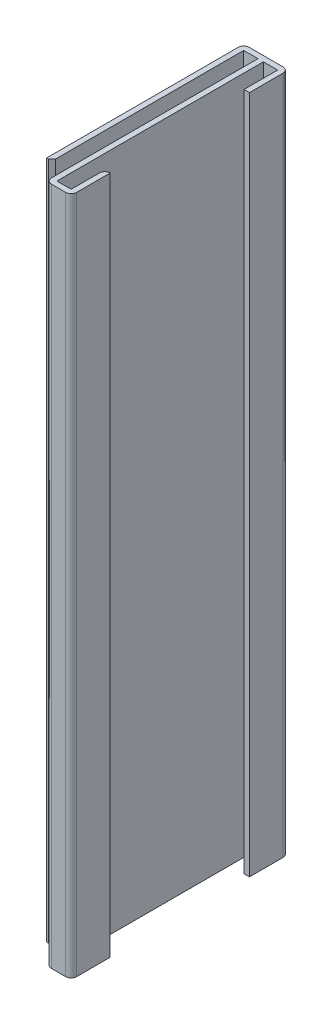
ISO-10303-21;
HEADER;
FILE_DESCRIPTION(('STEP AP214'),'2;1');
FILE_NAME('part.step','',(''),(''),'','','');
FILE_SCHEMA(('AUTOMOTIVE_DESIGN { 1 0 10303 214 1 1 1 1 }'));
ENDSEC;
DATA;
#1=APPLICATION_CONTEXT('core data for automotive mechanical design processes');
#2=APPLICATION_PROTOCOL_DEFINITION('international standard','automotive_design',2000,#1);
#3=PRODUCT_CONTEXT('',#1,'mechanical');
#4=PRODUCT('Part','Part','',(#3));
#5=PRODUCT_RELATED_PRODUCT_CATEGORY('part','',(#4));
#6=PRODUCT_DEFINITION_FORMATION('','',#4);
#7=PRODUCT_DEFINITION_CONTEXT('part definition',#1,'design');
#8=PRODUCT_DEFINITION('design','',#6,#7);
#9=PRODUCT_DEFINITION_SHAPE('','',#8);
#10=(LENGTH_UNIT() NAMED_UNIT(*) SI_UNIT(.MILLI.,.METRE.));
#11=(NAMED_UNIT(*) PLANE_ANGLE_UNIT() SI_UNIT($,.RADIAN.));
#12=(NAMED_UNIT(*) SI_UNIT($,.STERADIAN.) SOLID_ANGLE_UNIT());
#13=UNCERTAINTY_MEASURE_WITH_UNIT(LENGTH_MEASURE(1.E-05),#10,'distance_accuracy_value','');
#14=(GEOMETRIC_REPRESENTATION_CONTEXT(3) GLOBAL_UNCERTAINTY_ASSIGNED_CONTEXT((#13)) GLOBAL_UNIT_ASSIGNED_CONTEXT((#10,
#11,#12)) REPRESENTATION_CONTEXT('',''));
#15=CARTESIAN_POINT('',(0.,0.,0.));
#16=DIRECTION('',(0.,0.,1.));
#17=DIRECTION('',(1.,0.,0.));
#18=AXIS2_PLACEMENT_3D('',#15,#16,#17);
#19=CARTESIAN_POINT('',(3.3,0.,-32.));
#20=DIRECTION('',(0.,0.,-1.));
#21=DIRECTION('',(0.,-1.,0.));
#22=AXIS2_PLACEMENT_3D('',#19,#20,#21);
#23=PLANE('',#22);
#24=DIRECTION('',(-1.,0.,0.));
#25=VECTOR('',#24,1.);
#26=CARTESIAN_POINT('',(2.5,0.,-32.));
#27=LINE('',#26,#25);
#28=CARTESIAN_POINT('',(2.5,0.,-32.));
#29=VERTEX_POINT('',#28);
#30=CARTESIAN_POINT('',(-2.5,0.,-32.));
#31=VERTEX_POINT('',#30);
#32=EDGE_CURVE('E336',#29,#31,#27,.T.);
#33=ORIENTED_EDGE('',*,*,#32,.T.);
#34=DIRECTION('',(0.,-1.,0.));
#35=VECTOR('',#34,1.);
#36=CARTESIAN_POINT('',(-2.5,100.,-32.));
#37=LINE('',#36,#35);
#38=CARTESIAN_POINT('',(-2.5,100.,-32.));
#39=VERTEX_POINT('',#38);
#40=EDGE_CURVE('E10',#39,#31,#37,.T.);
#41=ORIENTED_EDGE('',*,*,#40,.F.);
#42=DIRECTION('',(-1.,0.,0.));
#43=VECTOR('',#42,1.);
#44=CARTESIAN_POINT('',(2.5,100.,-32.));
#45=LINE('',#44,#43);
#46=CARTESIAN_POINT('',(2.5,100.,-32.));
#47=VERTEX_POINT('',#46);
#48=EDGE_CURVE('E372',#47,#39,#45,.T.);
#49=ORIENTED_EDGE('',*,*,#48,.F.);
#50=DIRECTION('',(0.,-1.,0.));
#51=VECTOR('',#50,1.);
#52=CARTESIAN_POINT('',(2.5,100.,-32.));
#53=LINE('',#52,#51);
#54=EDGE_CURVE('E281',#47,#29,#53,.T.);
#55=ORIENTED_EDGE('',*,*,#54,.T.);
#56=EDGE_LOOP('',(#33,#41,#49,#55));
#57=FACE_BOUND('',#56,.T.);
#58=ADVANCED_FACE('F15',(#57),#23,.T.);
#59=CARTESIAN_POINT('',(-2.5,100.1646142425,-31.2));
#60=DIRECTION('',(0.,-1.,0.));
#61=DIRECTION('',(-1.,0.,0.));
#62=AXIS2_PLACEMENT_3D('',#59,#60,#61);
#63=CYLINDRICAL_SURFACE('',#62,0.8);
#64=CARTESIAN_POINT('',(-2.5,0.,-31.2));
#65=DIRECTION('',(0.,-1.,0.));
#66=DIRECTION('',(-1.,0.,0.));
#67=AXIS2_PLACEMENT_3D('',#64,#65,#66);
#68=CIRCLE('',#67,0.8);
#69=CARTESIAN_POINT('',(-3.3,0.,-31.2));
#70=VERTEX_POINT('',#69);
#71=EDGE_CURVE('E340',#70,#31,#68,.T.);
#72=ORIENTED_EDGE('',*,*,#71,.F.);
#73=DIRECTION('',(0.,-1.,0.));
#74=VECTOR('',#73,1.);
#75=CARTESIAN_POINT('',(-3.3,100.,-31.2));
#76=LINE('',#75,#74);
#77=CARTESIAN_POINT('',(-3.3,100.,-31.2));
#78=VERTEX_POINT('',#77);
#79=EDGE_CURVE('E26',#78,#70,#76,.T.);
#80=ORIENTED_EDGE('',*,*,#79,.F.);
#81=CARTESIAN_POINT('',(-2.5,100.,-31.2));
#82=DIRECTION('',(0.,1.,0.));
#83=DIRECTION('',(0.,0.,-1.));
#84=AXIS2_PLACEMENT_3D('',#81,#82,#83);
#85=CIRCLE('',#84,0.8);
#86=EDGE_CURVE('E276',#39,#78,#85,.T.);
#87=ORIENTED_EDGE('',*,*,#86,.F.);
#88=ORIENTED_EDGE('',*,*,#40,.T.);
#89=EDGE_LOOP('',(#72,#80,#87,#88));
#90=FACE_BOUND('',#89,.T.);
#91=ADVANCED_FACE('F424',(#90),#63,.T.);
#92=CARTESIAN_POINT('',(-3.3,0.,-32.));
#93=DIRECTION('',(-1.,0.,0.));
#94=DIRECTION('',(0.,0.,1.));
#95=AXIS2_PLACEMENT_3D('',#92,#93,#94);
#96=PLANE('',#95);
#97=DIRECTION('',(0.,0.,1.));
#98=VECTOR('',#97,1.);
#99=CARTESIAN_POINT('',(-3.3,0.,-31.2));
#100=LINE('',#99,#98);
#101=CARTESIAN_POINT('',(-3.3,0.,-3.));
#102=VERTEX_POINT('',#101);
#103=EDGE_CURVE('E382',#70,#102,#100,.T.);
#104=ORIENTED_EDGE('',*,*,#103,.T.);
#105=DIRECTION('',(0.,1.,0.));
#106=VECTOR('',#105,1.);
#107=CARTESIAN_POINT('',(-3.3,0.,-3.));
#108=LINE('',#107,#106);
#109=CARTESIAN_POINT('',(-3.3,100.,-3.));
#110=VERTEX_POINT('',#109);
#111=EDGE_CURVE('E303',#102,#110,#108,.T.);
#112=ORIENTED_EDGE('',*,*,#111,.T.);
#113=DIRECTION('',(0.,0.,1.));
#114=VECTOR('',#113,1.);
#115=CARTESIAN_POINT('',(-3.3,100.,-31.2));
#116=LINE('',#115,#114);
#117=EDGE_CURVE('E271',#78,#110,#116,.T.);
#118=ORIENTED_EDGE('',*,*,#117,.F.);
#119=ORIENTED_EDGE('',*,*,#79,.T.);
#120=EDGE_LOOP('',(#104,#112,#118,#119));
#121=FACE_BOUND('',#120,.T.);
#122=ADVANCED_FACE('F420',(#121),#96,.T.);
#123=CARTESIAN_POINT('',(-0.4,100.,-3.));
#124=DIRECTION('',(0.,0.,-1.));
#125=DIRECTION('',(0.,-1.,0.));
#126=AXIS2_PLACEMENT_3D('',#123,#124,#125);
#127=PLANE('',#126);
#128=DIRECTION('',(0.,1.,0.));
#129=VECTOR('',#128,1.);
#130=CARTESIAN_POINT('',(-3.,0.,-3.));
#131=LINE('',#130,#129);
#132=CARTESIAN_POINT('',(-3.,0.,-3.));
#133=VERTEX_POINT('',#132);
#134=CARTESIAN_POINT('',(-3.,100.,-3.));
#135=VERTEX_POINT('',#134);
#136=EDGE_CURVE('E19',#133,#135,#131,.T.);
#137=ORIENTED_EDGE('',*,*,#136,.T.);
#138=DIRECTION('',(1.,0.,0.));
#139=VECTOR('',#138,1.);
#140=CARTESIAN_POINT('',(-3.3,100.,-3.));
#141=LINE('',#140,#139);
#142=EDGE_CURVE('E275',#110,#135,#141,.T.);
#143=ORIENTED_EDGE('',*,*,#142,.F.);
#144=ORIENTED_EDGE('',*,*,#111,.F.);
#145=DIRECTION('',(1.,0.,0.));
#146=VECTOR('',#145,1.);
#147=CARTESIAN_POINT('',(-3.3,0.,-3.));
#148=LINE('',#147,#146);
#149=EDGE_CURVE('E375',#102,#133,#148,.T.);
#150=ORIENTED_EDGE('',*,*,#149,.T.);
#151=EDGE_LOOP('',(#137,#143,#144,#150));
#152=FACE_BOUND('',#151,.T.);
#153=ADVANCED_FACE('F761',(#152),#127,.F.);
#154=CARTESIAN_POINT('',(-2.5,0.,-3.5));
#155=DIRECTION('',(0.707106781186548,0.,0.707106781186548));
#156=DIRECTION('',(0.,-1.,0.));
#157=AXIS2_PLACEMENT_3D('',#154,#155,#156);
#158=PLANE('',#157);
#159=DIRECTION('',(-0.707106781186548,0.,0.707106781186548));
#160=VECTOR('',#159,1.);
#161=CARTESIAN_POINT('',(-2.5,100.,-3.5));
#162=LINE('',#161,#160);
#163=CARTESIAN_POINT('',(-2.5,100.,-3.5));
#164=VERTEX_POINT('',#163);
#165=EDGE_CURVE('E280',#164,#135,#162,.T.);
#166=ORIENTED_EDGE('',*,*,#165,.T.);
#167=ORIENTED_EDGE('',*,*,#136,.F.);
#168=DIRECTION('',(-0.707106781186548,0.,0.707106781186548));
#169=VECTOR('',#168,1.);
#170=CARTESIAN_POINT('',(-2.5,0.,-3.5));
#171=LINE('',#170,#169);
#172=CARTESIAN_POINT('',(-2.5,0.,-3.5));
#173=VERTEX_POINT('',#172);
#174=EDGE_CURVE('E331',#173,#133,#171,.T.);
#175=ORIENTED_EDGE('',*,*,#174,.F.);
#176=DIRECTION('',(0.,1.,0.));
#177=VECTOR('',#176,1.);
#178=CARTESIAN_POINT('',(-2.5,0.,-3.5));
#179=LINE('',#178,#177);
#180=EDGE_CURVE('E341',#173,#164,#179,.T.);
#181=ORIENTED_EDGE('',*,*,#180,.T.);
#182=EDGE_LOOP('',(#166,#167,#175,#181));
#183=FACE_BOUND('',#182,.T.);
#184=ADVANCED_FACE('F509',(#183),#158,.T.);
#185=CARTESIAN_POINT('',(-2.5,100.,-0.8));
#186=DIRECTION('',(1.,0.,0.));
#187=DIRECTION('',(0.,1.,0.));
#188=AXIS2_PLACEMENT_3D('',#185,#186,#187);
#189=PLANE('',#188);
#190=DIRECTION('',(0.,0.,-1.));
#191=VECTOR('',#190,1.);
#192=CARTESIAN_POINT('',(-2.5,0.,-3.5));
#193=LINE('',#192,#191);
#194=CARTESIAN_POINT('',(-2.5,0.,-31.2));
#195=VERTEX_POINT('',#194);
#196=EDGE_CURVE('E327',#173,#195,#193,.T.);
#197=ORIENTED_EDGE('',*,*,#196,.T.);
#198=DIRECTION('',(0.,-1.,0.));
#199=VECTOR('',#198,1.);
#200=CARTESIAN_POINT('',(-2.5,100.,-31.2));
#201=LINE('',#200,#199);
#202=CARTESIAN_POINT('',(-2.5,100.,-31.2));
#203=VERTEX_POINT('',#202);
#204=EDGE_CURVE('E249',#203,#195,#201,.T.);
#205=ORIENTED_EDGE('',*,*,#204,.F.);
#206=DIRECTION('',(0.,0.,-1.));
#207=VECTOR('',#206,1.);
#208=CARTESIAN_POINT('',(-2.5,100.,-3.5));
#209=LINE('',#208,#207);
#210=EDGE_CURVE('E399',#164,#203,#209,.T.);
#211=ORIENTED_EDGE('',*,*,#210,.F.);
#212=ORIENTED_EDGE('',*,*,#180,.F.);
#213=EDGE_LOOP('',(#197,#205,#211,#212));
#214=FACE_BOUND('',#213,.T.);
#215=ADVANCED_FACE('F505',(#214),#189,.T.);
#216=CARTESIAN_POINT('',(-2.5,100.,-31.2));
#217=DIRECTION('',(0.,0.,1.));
#218=DIRECTION('',(1.,0.,0.));
#219=AXIS2_PLACEMENT_3D('',#216,#217,#218);
#220=PLANE('',#219);
#221=DIRECTION('',(0.,-1.,0.));
#222=VECTOR('',#221,1.);
#223=CARTESIAN_POINT('',(-0.4,100.,-31.2));
#224=LINE('',#223,#222);
#225=CARTESIAN_POINT('',(-0.4,100.,-31.2));
#226=VERTEX_POINT('',#225);
#227=CARTESIAN_POINT('',(-0.4,0.,-31.2));
#228=VERTEX_POINT('',#227);
#229=EDGE_CURVE('E361',#226,#228,#224,.T.);
#230=ORIENTED_EDGE('',*,*,#229,.F.);
#231=DIRECTION('',(1.,0.,0.));
#232=VECTOR('',#231,1.);
#233=CARTESIAN_POINT('',(-2.5,100.,-31.2));
#234=LINE('',#233,#232);
#235=EDGE_CURVE('E322',#203,#226,#234,.T.);
#236=ORIENTED_EDGE('',*,*,#235,.F.);
#237=ORIENTED_EDGE('',*,*,#204,.T.);
#238=DIRECTION('',(1.,0.,0.));
#239=VECTOR('',#238,1.);
#240=CARTESIAN_POINT('',(-2.5,0.,-31.2));
#241=LINE('',#240,#239);
#242=EDGE_CURVE('E332',#195,#228,#241,.T.);
#243=ORIENTED_EDGE('',*,*,#242,.T.);
#244=EDGE_LOOP('',(#230,#236,#237,#243));
#245=FACE_BOUND('',#244,.T.);
#246=ADVANCED_FACE('F501',(#245),#220,.T.);
#247=CARTESIAN_POINT('',(-0.4,100.,-31.2));
#248=DIRECTION('',(-1.,0.,0.));
#249=DIRECTION('',(0.,0.,1.));
#250=AXIS2_PLACEMENT_3D('',#247,#248,#249);
#251=PLANE('',#250);
#252=DIRECTION('',(0.,0.,1.));
#253=VECTOR('',#252,1.);
#254=CARTESIAN_POINT('',(-0.4,100.,-31.2));
#255=LINE('',#254,#253);
#256=CARTESIAN_POINT('',(-0.4,100.,-0.8));
#257=VERTEX_POINT('',#256);
#258=EDGE_CURVE('E270',#226,#257,#255,.T.);
#259=ORIENTED_EDGE('',*,*,#258,.F.);
#260=ORIENTED_EDGE('',*,*,#229,.T.);
#261=DIRECTION('',(0.,0.,-1.));
#262=VECTOR('',#261,1.);
#263=CARTESIAN_POINT('',(-0.4,0.,-0.8));
#264=LINE('',#263,#262);
#265=CARTESIAN_POINT('',(-0.4,0.,-0.8));
#266=VERTEX_POINT('',#265);
#267=EDGE_CURVE('E395',#266,#228,#264,.T.);
#268=ORIENTED_EDGE('',*,*,#267,.F.);
#269=DIRECTION('',(0.,-1.,0.));
#270=VECTOR('',#269,1.);
#271=CARTESIAN_POINT('',(-0.4,100.,-0.8));
#272=LINE('',#271,#270);
#273=EDGE_CURVE('E364',#257,#266,#272,.T.);
#274=ORIENTED_EDGE('',*,*,#273,.F.);
#275=EDGE_LOOP('',(#259,#260,#268,#274));
#276=FACE_BOUND('',#275,.T.);
#277=ADVANCED_FACE('F498',(#276),#251,.T.);
#278=CARTESIAN_POINT('',(0.4,100.1646142425,-0.8));
#279=DIRECTION('',(0.,-1.,0.));
#280=DIRECTION('',(0.,0.,1.));
#281=AXIS2_PLACEMENT_3D('',#278,#279,#280);
#282=CYLINDRICAL_SURFACE('',#281,0.8);
#283=CARTESIAN_POINT('',(0.4,0.,-0.8));
#284=DIRECTION('',(0.,-1.,0.));
#285=DIRECTION('',(0.,0.,1.));
#286=AXIS2_PLACEMENT_3D('',#283,#284,#285);
#287=CIRCLE('',#286,0.8);
#288=CARTESIAN_POINT('',(0.4,0.,0.));
#289=VERTEX_POINT('',#288);
#290=EDGE_CURVE('E439',#289,#266,#287,.T.);
#291=ORIENTED_EDGE('',*,*,#290,.F.);
#292=DIRECTION('',(0.,-1.,0.));
#293=VECTOR('',#292,1.);
#294=CARTESIAN_POINT('',(0.4,100.,0.));
#295=LINE('',#294,#293);
#296=CARTESIAN_POINT('',(0.4,100.,0.));
#297=VERTEX_POINT('',#296);
#298=EDGE_CURVE('E360',#297,#289,#295,.T.);
#299=ORIENTED_EDGE('',*,*,#298,.F.);
#300=CARTESIAN_POINT('',(0.4,100.,-0.8));
#301=DIRECTION('',(0.,1.,0.));
#302=DIRECTION('',(-1.,0.,0.));
#303=AXIS2_PLACEMENT_3D('',#300,#301,#302);
#304=CIRCLE('',#303,0.8);
#305=EDGE_CURVE('E265',#257,#297,#304,.T.);
#306=ORIENTED_EDGE('',*,*,#305,.F.);
#307=ORIENTED_EDGE('',*,*,#273,.T.);
#308=EDGE_LOOP('',(#291,#299,#306,#307));
#309=FACE_BOUND('',#308,.T.);
#310=ADVANCED_FACE('F493',(#309),#282,.T.);
#311=CARTESIAN_POINT('',(-3.3,0.,0.));
#312=DIRECTION('',(0.,0.,1.));
#313=DIRECTION('',(1.,0.,0.));
#314=AXIS2_PLACEMENT_3D('',#311,#312,#313);
#315=PLANE('',#314);
#316=DIRECTION('',(1.,0.,0.));
#317=VECTOR('',#316,1.);
#318=CARTESIAN_POINT('',(0.4,100.,0.));
#319=LINE('',#318,#317);
#320=CARTESIAN_POINT('',(2.5,100.,0.));
#321=VERTEX_POINT('',#320);
#322=EDGE_CURVE('E269',#297,#321,#319,.T.);
#323=ORIENTED_EDGE('',*,*,#322,.F.);
#324=ORIENTED_EDGE('',*,*,#298,.T.);
#325=DIRECTION('',(1.,0.,0.));
#326=VECTOR('',#325,1.);
#327=CARTESIAN_POINT('',(0.4,0.,0.));
#328=LINE('',#327,#326);
#329=CARTESIAN_POINT('',(2.5,0.,0.));
#330=VERTEX_POINT('',#329);
#331=EDGE_CURVE('E296',#289,#330,#328,.T.);
#332=ORIENTED_EDGE('',*,*,#331,.T.);
#333=DIRECTION('',(0.,-1.,0.));
#334=VECTOR('',#333,1.);
#335=CARTESIAN_POINT('',(2.5,100.,0.));
#336=LINE('',#335,#334);
#337=EDGE_CURVE('E39',#321,#330,#336,.T.);
#338=ORIENTED_EDGE('',*,*,#337,.F.);
#339=EDGE_LOOP('',(#323,#324,#332,#338));
#340=FACE_BOUND('',#339,.T.);
#341=ADVANCED_FACE('F489',(#340),#315,.T.);
#342=CARTESIAN_POINT('',(2.5,100.1646142425,-0.8));
#343=DIRECTION('',(0.,-1.,0.));
#344=DIRECTION('',(1.,0.,0.));
#345=AXIS2_PLACEMENT_3D('',#342,#343,#344);
#346=CYLINDRICAL_SURFACE('',#345,0.8);
#347=CARTESIAN_POINT('',(2.5,0.,-0.8));
#348=DIRECTION('',(0.,-1.,0.));
#349=DIRECTION('',(1.,0.,0.));
#350=AXIS2_PLACEMENT_3D('',#347,#348,#349);
#351=CIRCLE('',#350,0.8);
#352=CARTESIAN_POINT('',(3.3,0.,-0.8));
#353=VERTEX_POINT('',#352);
#354=EDGE_CURVE('E292',#353,#330,#351,.T.);
#355=ORIENTED_EDGE('',*,*,#354,.F.);
#356=DIRECTION('',(0.,-1.,0.));
#357=VECTOR('',#356,1.);
#358=CARTESIAN_POINT('',(3.3,100.,-0.8));
#359=LINE('',#358,#357);
#360=CARTESIAN_POINT('',(3.3,100.,-0.8));
#361=VERTEX_POINT('',#360);
#362=EDGE_CURVE('E429',#361,#353,#359,.T.);
#363=ORIENTED_EDGE('',*,*,#362,.F.);
#364=CARTESIAN_POINT('',(2.5,100.,-0.8));
#365=DIRECTION('',(0.,1.,0.));
#366=DIRECTION('',(0.,0.,1.));
#367=AXIS2_PLACEMENT_3D('',#364,#365,#366);
#368=CIRCLE('',#367,0.8);
#369=EDGE_CURVE('E260',#321,#361,#368,.T.);
#370=ORIENTED_EDGE('',*,*,#369,.F.);
#371=ORIENTED_EDGE('',*,*,#337,.T.);
#372=EDGE_LOOP('',(#355,#363,#370,#371));
#373=FACE_BOUND('',#372,.T.);
#374=ADVANCED_FACE('F488',(#373),#346,.T.);
#375=CARTESIAN_POINT('',(3.3,100.1646142425,-4.95));
#376=DIRECTION('',(0.,-1.,0.));
#377=DIRECTION('',(-1.,0.,0.));
#378=AXIS2_PLACEMENT_3D('',#375,#376,#377);
#379=CYLINDRICAL_SURFACE('',#378,0.8);
#380=DIRECTION('',(0.,-1.,0.));
#381=VECTOR('',#380,1.);
#382=CARTESIAN_POINT('',(3.3,100.,-5.75));
#383=LINE('',#382,#381);
#384=CARTESIAN_POINT('',(3.3,100.,-5.75));
#385=VERTEX_POINT('',#384);
#386=CARTESIAN_POINT('',(3.3,0.,-5.75));
#387=VERTEX_POINT('',#386);
#388=EDGE_CURVE('E347',#385,#387,#383,.T.);
#389=ORIENTED_EDGE('',*,*,#388,.T.);
#390=CARTESIAN_POINT('',(3.3,0.,-4.95));
#391=DIRECTION('',(0.,-1.,0.));
#392=DIRECTION('',(-1.,0.,0.));
#393=AXIS2_PLACEMENT_3D('',#390,#391,#392);
#394=CIRCLE('',#393,0.8);
#395=CARTESIAN_POINT('',(2.5,0.,-4.95));
#396=VERTEX_POINT('',#395);
#397=EDGE_CURVE('E254',#396,#387,#394,.T.);
#398=ORIENTED_EDGE('',*,*,#397,.F.);
#399=DIRECTION('',(0.,-1.,0.));
#400=VECTOR('',#399,1.);
#401=CARTESIAN_POINT('',(2.5,100.,-4.95));
#402=LINE('',#401,#400);
#403=CARTESIAN_POINT('',(2.5,100.,-4.95));
#404=VERTEX_POINT('',#403);
#405=EDGE_CURVE('E291',#404,#396,#402,.T.);
#406=ORIENTED_EDGE('',*,*,#405,.F.);
#407=CARTESIAN_POINT('',(3.3,100.,-4.95));
#408=DIRECTION('',(0.,1.,0.));
#409=DIRECTION('',(0.,0.,-1.));
#410=AXIS2_PLACEMENT_3D('',#407,#408,#409);
#411=CIRCLE('',#410,0.8);
#412=EDGE_CURVE('E257',#385,#404,#411,.T.);
#413=ORIENTED_EDGE('',*,*,#412,.F.);
#414=EDGE_LOOP('',(#389,#398,#406,#413));
#415=FACE_BOUND('',#414,.T.);
#416=ADVANCED_FACE('F480',(#415),#379,.T.);
#417=CARTESIAN_POINT('',(0.,100.,0.));
#418=DIRECTION('',(0.,1.,0.));
#419=DIRECTION('',(1.,0.,0.));
#420=AXIS2_PLACEMENT_3D('',#417,#418,#419);
#421=PLANE('',#420);
#422=ORIENTED_EDGE('',*,*,#48,.T.);
#423=ORIENTED_EDGE('',*,*,#86,.T.);
#424=ORIENTED_EDGE('',*,*,#117,.T.);
#425=ORIENTED_EDGE('',*,*,#142,.T.);
#426=ORIENTED_EDGE('',*,*,#165,.F.);
#427=ORIENTED_EDGE('',*,*,#210,.T.);
#428=ORIENTED_EDGE('',*,*,#235,.T.);
#429=ORIENTED_EDGE('',*,*,#258,.T.);
#430=ORIENTED_EDGE('',*,*,#305,.T.);
#431=ORIENTED_EDGE('',*,*,#322,.T.);
#432=ORIENTED_EDGE('',*,*,#369,.T.);
#433=DIRECTION('',(0.,0.,-1.));
#434=VECTOR('',#433,1.);
#435=CARTESIAN_POINT('',(3.3,100.,-0.8));
#436=LINE('',#435,#434);
#437=EDGE_CURVE('E432',#361,#385,#436,.T.);
#438=ORIENTED_EDGE('',*,*,#437,.T.);
#439=ORIENTED_EDGE('',*,*,#412,.T.);
#440=DIRECTION('',(0.,0.,-1.));
#441=VECTOR('',#440,1.);
#442=CARTESIAN_POINT('',(2.5,100.,-0.8));
#443=LINE('',#442,#441);
#444=CARTESIAN_POINT('',(2.5,100.,-0.8));
#445=VERTEX_POINT('',#444);
#446=EDGE_CURVE('E264',#445,#404,#443,.T.);
#447=ORIENTED_EDGE('',*,*,#446,.F.);
#448=DIRECTION('',(1.,0.,0.));
#449=VECTOR('',#448,1.);
#450=CARTESIAN_POINT('',(0.4,100.,-0.8));
#451=LINE('',#450,#449);
#452=CARTESIAN_POINT('',(0.4,100.,-0.8));
#453=VERTEX_POINT('',#452);
#454=EDGE_CURVE('E402',#453,#445,#451,.T.);
#455=ORIENTED_EDGE('',*,*,#454,.F.);
#456=DIRECTION('',(0.,0.,1.));
#457=VECTOR('',#456,1.);
#458=CARTESIAN_POINT('',(0.4,100.,-31.2));
#459=LINE('',#458,#457);
#460=CARTESIAN_POINT('',(0.4,100.,-31.2));
#461=VERTEX_POINT('',#460);
#462=EDGE_CURVE('E298',#461,#453,#459,.T.);
#463=ORIENTED_EDGE('',*,*,#462,.F.);
#464=DIRECTION('',(-1.,0.,0.));
#465=VECTOR('',#464,1.);
#466=CARTESIAN_POINT('',(2.5,100.,-31.2));
#467=LINE('',#466,#465);
#468=CARTESIAN_POINT('',(2.5,100.,-31.2));
#469=VERTEX_POINT('',#468);
#470=EDGE_CURVE('E286',#469,#461,#467,.T.);
#471=ORIENTED_EDGE('',*,*,#470,.F.);
#472=DIRECTION('',(0.,0.,-1.));
#473=VECTOR('',#472,1.);
#474=CARTESIAN_POINT('',(2.5,100.,-26.25));
#475=LINE('',#474,#473);
#476=CARTESIAN_POINT('',(2.5,100.,-26.25));
#477=VERTEX_POINT('',#476);
#478=EDGE_CURVE('E223',#477,#469,#475,.T.);
#479=ORIENTED_EDGE('',*,*,#478,.F.);
#480=DIRECTION('',(-1.,0.,0.));
#481=VECTOR('',#480,1.);
#482=CARTESIAN_POINT('',(3.3,100.,-26.25));
#483=LINE('',#482,#481);
#484=CARTESIAN_POINT('',(3.3,100.,-26.25));
#485=VERTEX_POINT('',#484);
#486=EDGE_CURVE('E219',#485,#477,#483,.T.);
#487=ORIENTED_EDGE('',*,*,#486,.F.);
#488=DIRECTION('',(0.,0.,-1.));
#489=VECTOR('',#488,1.);
#490=CARTESIAN_POINT('',(3.3,100.,-26.25));
#491=LINE('',#490,#489);
#492=CARTESIAN_POINT('',(3.3,100.,-31.2));
#493=VERTEX_POINT('',#492);
#494=EDGE_CURVE('E348',#485,#493,#491,.T.);
#495=ORIENTED_EDGE('',*,*,#494,.T.);
#496=CARTESIAN_POINT('',(2.5,100.,-31.2));
#497=DIRECTION('',(0.,1.,0.));
#498=DIRECTION('',(1.,0.,0.));
#499=AXIS2_PLACEMENT_3D('',#496,#497,#498);
#500=CIRCLE('',#499,0.8);
#501=EDGE_CURVE('E284',#493,#47,#500,.T.);
#502=ORIENTED_EDGE('',*,*,#501,.T.);
#503=EDGE_LOOP('',(#422,#423,#424,#425,#426,#427,#428,#429,#430,#431,#432,#438,#439,#447,#455,
#463,#471,#479,#487,#495,#502));
#504=FACE_BOUND('',#503,.T.);
#505=ADVANCED_FACE('F666',(#504),#421,.T.);
#506=CARTESIAN_POINT('',(0.4,100.,-0.8));
#507=DIRECTION('',(0.,0.,1.));
#508=DIRECTION('',(1.,0.,0.));
#509=AXIS2_PLACEMENT_3D('',#506,#507,#508);
#510=PLANE('',#509);
#511=DIRECTION('',(0.,-1.,0.));
#512=VECTOR('',#511,1.);
#513=CARTESIAN_POINT('',(0.4,100.,-0.8));
#514=LINE('',#513,#512);
#515=CARTESIAN_POINT('',(0.4,0.,-0.8));
#516=VERTEX_POINT('',#515);
#517=EDGE_CURVE('E302',#453,#516,#514,.T.);
#518=ORIENTED_EDGE('',*,*,#517,.F.);
#519=ORIENTED_EDGE('',*,*,#454,.T.);
#520=DIRECTION('',(0.,-1.,0.));
#521=VECTOR('',#520,1.);
#522=CARTESIAN_POINT('',(2.5,100.,-0.8));
#523=LINE('',#522,#521);
#524=CARTESIAN_POINT('',(2.5,0.,-0.8));
#525=VERTEX_POINT('',#524);
#526=EDGE_CURVE('E261',#445,#525,#523,.T.);
#527=ORIENTED_EDGE('',*,*,#526,.T.);
#528=DIRECTION('',(1.,0.,0.));
#529=VECTOR('',#528,1.);
#530=CARTESIAN_POINT('',(0.4,0.,-0.8));
#531=LINE('',#530,#529);
#532=EDGE_CURVE('E255',#516,#525,#531,.T.);
#533=ORIENTED_EDGE('',*,*,#532,.F.);
#534=EDGE_LOOP('',(#518,#519,#527,#533));
#535=FACE_BOUND('',#534,.T.);
#536=ADVANCED_FACE('F17',(#535),#510,.F.);
#537=CARTESIAN_POINT('',(0.4,100.,-31.2));
#538=DIRECTION('',(-1.,0.,0.));
#539=DIRECTION('',(0.,0.,1.));
#540=AXIS2_PLACEMENT_3D('',#537,#538,#539);
#541=PLANE('',#540);
#542=DIRECTION('',(0.,-1.,0.));
#543=VECTOR('',#542,1.);
#544=CARTESIAN_POINT('',(0.4,100.,-31.2));
#545=LINE('',#544,#543);
#546=CARTESIAN_POINT('',(0.4,0.,-31.2));
#547=VERTEX_POINT('',#546);
#548=EDGE_CURVE('E290',#461,#547,#545,.T.);
#549=ORIENTED_EDGE('',*,*,#548,.F.);
#550=ORIENTED_EDGE('',*,*,#462,.T.);
#551=ORIENTED_EDGE('',*,*,#517,.T.);
#552=DIRECTION('',(0.,0.,1.));
#553=VECTOR('',#552,1.);
#554=CARTESIAN_POINT('',(0.4,0.,-31.2));
#555=LINE('',#554,#553);
#556=EDGE_CURVE('E357',#547,#516,#555,.T.);
#557=ORIENTED_EDGE('',*,*,#556,.F.);
#558=EDGE_LOOP('',(#549,#550,#551,#557));
#559=FACE_BOUND('',#558,.T.);
#560=ADVANCED_FACE('F467',(#559),#541,.F.);
#561=CARTESIAN_POINT('',(2.5,100.,-31.2));
#562=DIRECTION('',(0.,0.,-1.));
#563=DIRECTION('',(0.,-1.,0.));
#564=AXIS2_PLACEMENT_3D('',#561,#562,#563);
#565=PLANE('',#564);
#566=DIRECTION('',(0.,-1.,0.));
#567=VECTOR('',#566,1.);
#568=CARTESIAN_POINT('',(2.5,100.,-31.2));
#569=LINE('',#568,#567);
#570=CARTESIAN_POINT('',(2.5,0.,-31.2));
#571=VERTEX_POINT('',#570);
#572=EDGE_CURVE('E229',#469,#571,#569,.T.);
#573=ORIENTED_EDGE('',*,*,#572,.F.);
#574=ORIENTED_EDGE('',*,*,#470,.T.);
#575=ORIENTED_EDGE('',*,*,#548,.T.);
#576=DIRECTION('',(-1.,0.,0.));
#577=VECTOR('',#576,1.);
#578=CARTESIAN_POINT('',(2.5,0.,-31.2));
#579=LINE('',#578,#577);
#580=EDGE_CURVE('E234',#571,#547,#579,.T.);
#581=ORIENTED_EDGE('',*,*,#580,.F.);
#582=EDGE_LOOP('',(#573,#574,#575,#581));
#583=FACE_BOUND('',#582,.T.);
#584=ADVANCED_FACE('F464',(#583),#565,.F.);
#585=CARTESIAN_POINT('',(2.5,100.,-0.8));
#586=DIRECTION('',(1.,0.,0.));
#587=DIRECTION('',(0.,1.,0.));
#588=AXIS2_PLACEMENT_3D('',#585,#586,#587);
#589=PLANE('',#588);
#590=DIRECTION('',(0.,0.,-1.));
#591=VECTOR('',#590,1.);
#592=CARTESIAN_POINT('',(2.5,0.,-0.8));
#593=LINE('',#592,#591);
#594=EDGE_CURVE('E251',#525,#396,#593,.T.);
#595=ORIENTED_EDGE('',*,*,#594,.F.);
#596=ORIENTED_EDGE('',*,*,#526,.F.);
#597=ORIENTED_EDGE('',*,*,#446,.T.);
#598=ORIENTED_EDGE('',*,*,#405,.T.);
#599=EDGE_LOOP('',(#595,#596,#597,#598));
#600=FACE_BOUND('',#599,.T.);
#601=ADVANCED_FACE('F476',(#600),#589,.F.);
#602=CARTESIAN_POINT('',(2.5,100.,-0.8));
#603=DIRECTION('',(1.,0.,0.));
#604=DIRECTION('',(0.,1.,0.));
#605=AXIS2_PLACEMENT_3D('',#602,#603,#604);
#606=PLANE('',#605);
#607=ORIENTED_EDGE('',*,*,#478,.T.);
#608=ORIENTED_EDGE('',*,*,#572,.T.);
#609=DIRECTION('',(0.,0.,-1.));
#610=VECTOR('',#609,1.);
#611=CARTESIAN_POINT('',(2.5,0.,-26.25));
#612=LINE('',#611,#610);
#613=CARTESIAN_POINT('',(2.5,0.,-26.25));
#614=VERTEX_POINT('',#613);
#615=EDGE_CURVE('E226',#614,#571,#612,.T.);
#616=ORIENTED_EDGE('',*,*,#615,.F.);
#617=DIRECTION('',(0.,-1.,0.));
#618=VECTOR('',#617,1.);
#619=CARTESIAN_POINT('',(2.5,100.,-26.25));
#620=LINE('',#619,#618);
#621=EDGE_CURVE('E212',#477,#614,#620,.T.);
#622=ORIENTED_EDGE('',*,*,#621,.F.);
#623=EDGE_LOOP('',(#607,#608,#616,#622));
#624=FACE_BOUND('',#623,.T.);
#625=ADVANCED_FACE('F227',(#624),#606,.F.);
#626=CARTESIAN_POINT('',(5.589680650253,100.,-26.25));
#627=DIRECTION('',(0.,0.,-1.));
#628=DIRECTION('',(0.,-1.,0.));
#629=AXIS2_PLACEMENT_3D('',#626,#627,#628);
#630=PLANE('',#629);
#631=ORIENTED_EDGE('',*,*,#486,.T.);
#632=ORIENTED_EDGE('',*,*,#621,.T.);
#633=DIRECTION('',(-1.,0.,0.));
#634=VECTOR('',#633,1.);
#635=CARTESIAN_POINT('',(3.3,0.,-26.25));
#636=LINE('',#635,#634);
#637=CARTESIAN_POINT('',(3.3,0.,-26.25));
#638=VERTEX_POINT('',#637);
#639=EDGE_CURVE('E217',#638,#614,#636,.T.);
#640=ORIENTED_EDGE('',*,*,#639,.F.);
#641=DIRECTION('',(0.,-1.,0.));
#642=VECTOR('',#641,1.);
#643=CARTESIAN_POINT('',(3.3,100.,-26.25));
#644=LINE('',#643,#642);
#645=EDGE_CURVE('E344',#485,#638,#644,.T.);
#646=ORIENTED_EDGE('',*,*,#645,.F.);
#647=EDGE_LOOP('',(#631,#632,#640,#646));
#648=FACE_BOUND('',#647,.T.);
#649=ADVANCED_FACE('F214',(#648),#630,.F.);
#650=CARTESIAN_POINT('',(3.3,0.,0.));
#651=DIRECTION('',(1.,0.,0.));
#652=DIRECTION('',(0.,1.,0.));
#653=AXIS2_PLACEMENT_3D('',#650,#651,#652);
#654=PLANE('',#653);
#655=DIRECTION('',(0.,0.,-1.));
#656=VECTOR('',#655,1.);
#657=CARTESIAN_POINT('',(3.3,0.,-0.8));
#658=LINE('',#657,#656);
#659=EDGE_CURVE('E297',#353,#387,#658,.T.);
#660=ORIENTED_EDGE('',*,*,#659,.T.);
#661=ORIENTED_EDGE('',*,*,#388,.F.);
#662=ORIENTED_EDGE('',*,*,#437,.F.);
#663=ORIENTED_EDGE('',*,*,#362,.T.);
#664=EDGE_LOOP('',(#660,#661,#662,#663));
#665=FACE_BOUND('',#664,.T.);
#666=ADVANCED_FACE('F484',(#665),#654,.T.);
#667=CARTESIAN_POINT('',(3.3,0.,0.));
#668=DIRECTION('',(1.,0.,0.));
#669=DIRECTION('',(0.,1.,0.));
#670=AXIS2_PLACEMENT_3D('',#667,#668,#669);
#671=PLANE('',#670);
#672=ORIENTED_EDGE('',*,*,#494,.F.);
#673=ORIENTED_EDGE('',*,*,#645,.T.);
#674=DIRECTION('',(0.,0.,-1.));
#675=VECTOR('',#674,1.);
#676=CARTESIAN_POINT('',(3.3,0.,-26.25));
#677=LINE('',#676,#675);
#678=CARTESIAN_POINT('',(3.3,0.,-31.2));
#679=VERTEX_POINT('',#678);
#680=EDGE_CURVE('E238',#638,#679,#677,.T.);
#681=ORIENTED_EDGE('',*,*,#680,.T.);
#682=DIRECTION('',(0.,-1.,0.));
#683=VECTOR('',#682,1.);
#684=CARTESIAN_POINT('',(3.3,100.,-31.2));
#685=LINE('',#684,#683);
#686=EDGE_CURVE('E203',#493,#679,#685,.T.);
#687=ORIENTED_EDGE('',*,*,#686,.F.);
#688=EDGE_LOOP('',(#672,#673,#681,#687));
#689=FACE_BOUND('',#688,.T.);
#690=ADVANCED_FACE('F409',(#689),#671,.T.);
#691=CARTESIAN_POINT('',(2.5,100.1646142425,-31.2));
#692=DIRECTION('',(0.,-1.,0.));
#693=DIRECTION('',(0.,0.,-1.));
#694=AXIS2_PLACEMENT_3D('',#691,#692,#693);
#695=CYLINDRICAL_SURFACE('',#694,0.8);
#696=CARTESIAN_POINT('',(2.5,0.,-31.2));
#697=DIRECTION('',(0.,-1.,0.));
#698=DIRECTION('',(0.,0.,-1.));
#699=AXIS2_PLACEMENT_3D('',#696,#697,#698);
#700=CIRCLE('',#699,0.8);
#701=EDGE_CURVE('E285',#29,#679,#700,.T.);
#702=ORIENTED_EDGE('',*,*,#701,.F.);
#703=ORIENTED_EDGE('',*,*,#54,.F.);
#704=ORIENTED_EDGE('',*,*,#501,.F.);
#705=ORIENTED_EDGE('',*,*,#686,.T.);
#706=EDGE_LOOP('',(#702,#703,#704,#705));
#707=FACE_BOUND('',#706,.T.);
#708=ADVANCED_FACE('F658',(#707),#695,.T.);
#709=CARTESIAN_POINT('',(0.,0.,0.));
#710=DIRECTION('',(0.,1.,0.));
#711=DIRECTION('',(1.,0.,0.));
#712=AXIS2_PLACEMENT_3D('',#709,#710,#711);
#713=PLANE('',#712);
#714=ORIENTED_EDGE('',*,*,#680,.F.);
#715=ORIENTED_EDGE('',*,*,#639,.T.);
#716=ORIENTED_EDGE('',*,*,#615,.T.);
#717=ORIENTED_EDGE('',*,*,#580,.T.);
#718=ORIENTED_EDGE('',*,*,#556,.T.);
#719=ORIENTED_EDGE('',*,*,#532,.T.);
#720=ORIENTED_EDGE('',*,*,#594,.T.);
#721=ORIENTED_EDGE('',*,*,#397,.T.);
#722=ORIENTED_EDGE('',*,*,#659,.F.);
#723=ORIENTED_EDGE('',*,*,#354,.T.);
#724=ORIENTED_EDGE('',*,*,#331,.F.);
#725=ORIENTED_EDGE('',*,*,#290,.T.);
#726=ORIENTED_EDGE('',*,*,#267,.T.);
#727=ORIENTED_EDGE('',*,*,#242,.F.);
#728=ORIENTED_EDGE('',*,*,#196,.F.);
#729=ORIENTED_EDGE('',*,*,#174,.T.);
#730=ORIENTED_EDGE('',*,*,#149,.F.);
#731=ORIENTED_EDGE('',*,*,#103,.F.);
#732=ORIENTED_EDGE('',*,*,#71,.T.);
#733=ORIENTED_EDGE('',*,*,#32,.F.);
#734=ORIENTED_EDGE('',*,*,#701,.T.);
#735=EDGE_LOOP('',(#714,#715,#716,#717,#718,#719,#720,#721,#722,#723,#724,#725,#726,#727,#728,
#729,#730,#731,#732,#733,#734));
#736=FACE_BOUND('',#735,.T.);
#737=ADVANCED_FACE('F236',(#736),#713,.F.);
#738=CLOSED_SHELL('',(#58,#91,#122,#153,#184,#215,#246,#277,#310,#341,#374,#416,#505,#536,#560,
#584,#601,#625,#649,#666,#690,#708,#737));
#739=MANIFOLD_SOLID_BREP('B1',#738);
#740=ADVANCED_BREP_SHAPE_REPRESENTATION('',(#18,#739),#14);
#741=SHAPE_DEFINITION_REPRESENTATION(#9,#740);
ENDSEC;
END-ISO-10303-21;
